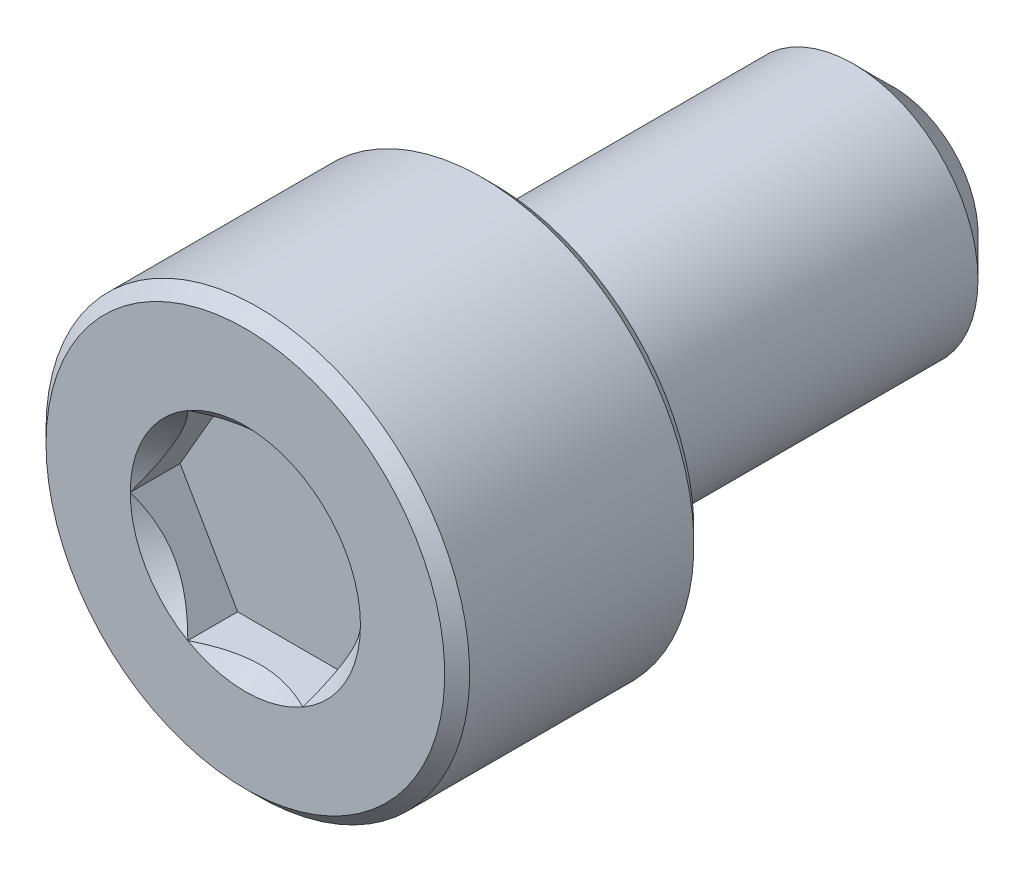
ISO-10303-21;
HEADER;
FILE_DESCRIPTION(('STEP AP214'),'2;1');
FILE_NAME('part.step','',(''),(''),'','','');
FILE_SCHEMA(('AUTOMOTIVE_DESIGN { 1 0 10303 214 1 1 1 1 }'));
ENDSEC;
DATA;
#1=APPLICATION_CONTEXT('core data for automotive mechanical design processes');
#2=APPLICATION_PROTOCOL_DEFINITION('international standard','automotive_design',2000,#1);
#3=PRODUCT_CONTEXT('',#1,'mechanical');
#4=PRODUCT('Part','Part','',(#3));
#5=PRODUCT_RELATED_PRODUCT_CATEGORY('part','',(#4));
#6=PRODUCT_DEFINITION_FORMATION('','',#4);
#7=PRODUCT_DEFINITION_CONTEXT('part definition',#1,'design');
#8=PRODUCT_DEFINITION('design','',#6,#7);
#9=PRODUCT_DEFINITION_SHAPE('','',#8);
#10=(LENGTH_UNIT() NAMED_UNIT(*) SI_UNIT(.MILLI.,.METRE.));
#11=(NAMED_UNIT(*) PLANE_ANGLE_UNIT() SI_UNIT($,.RADIAN.));
#12=(NAMED_UNIT(*) SI_UNIT($,.STERADIAN.) SOLID_ANGLE_UNIT());
#13=UNCERTAINTY_MEASURE_WITH_UNIT(LENGTH_MEASURE(1.E-05),#10,'distance_accuracy_value','');
#14=(GEOMETRIC_REPRESENTATION_CONTEXT(3) GLOBAL_UNCERTAINTY_ASSIGNED_CONTEXT((#13)) GLOBAL_UNIT_ASSIGNED_CONTEXT((#10,
#11,#12)) REPRESENTATION_CONTEXT('',''));
#15=CARTESIAN_POINT('',(0.,0.,0.));
#16=DIRECTION('',(0.,0.,1.));
#17=DIRECTION('',(1.,0.,0.));
#18=AXIS2_PLACEMENT_3D('',#15,#16,#17);
#19=CARTESIAN_POINT('',(0.,4.,6.5));
#20=DIRECTION('',(0.,0.,1.));
#21=DIRECTION('',(1.,0.,0.));
#22=AXIS2_PLACEMENT_3D('',#19,#20,#21);
#23=PLANE('',#22);
#24=CARTESIAN_POINT('',(0.,0.,6.5));
#25=DIRECTION('',(0.,0.,1.));
#26=DIRECTION('',(1.,0.,0.));
#27=AXIS2_PLACEMENT_3D('',#24,#25,#26);
#28=CIRCLE('',#27,2.3094010767585);
#29=CARTESIAN_POINT('',(2.3094010767585,0.,6.5));
#30=VERTEX_POINT('',#29);
#31=CARTESIAN_POINT('',(1.15470053837925,2.,6.5));
#32=VERTEX_POINT('',#31);
#33=EDGE_CURVE('E95',#30,#32,#28,.T.);
#34=ORIENTED_EDGE('',*,*,#33,.F.);
#35=CARTESIAN_POINT('',(1.15470053837925,-2.,6.5));
#36=VERTEX_POINT('',#35);
#37=EDGE_CURVE('E55',#36,#30,#28,.T.);
#38=ORIENTED_EDGE('',*,*,#37,.F.);
#39=CARTESIAN_POINT('',(-1.15470053837925,-2.,6.5));
#40=VERTEX_POINT('',#39);
#41=EDGE_CURVE('E298',#40,#36,#28,.T.);
#42=ORIENTED_EDGE('',*,*,#41,.F.);
#43=CARTESIAN_POINT('',(-2.3094010767585,0.,6.5));
#44=VERTEX_POINT('',#43);
#45=EDGE_CURVE('E62',#44,#40,#28,.T.);
#46=ORIENTED_EDGE('',*,*,#45,.F.);
#47=CARTESIAN_POINT('',(-1.15470053837925,2.,6.5));
#48=VERTEX_POINT('',#47);
#49=EDGE_CURVE('E130',#48,#44,#28,.T.);
#50=ORIENTED_EDGE('',*,*,#49,.F.);
#51=EDGE_CURVE('E104',#32,#48,#28,.T.);
#52=ORIENTED_EDGE('',*,*,#51,.F.);
#53=EDGE_LOOP('',(#34,#38,#42,#46,#50,#52));
#54=FACE_BOUND('',#53,.T.);
#55=CARTESIAN_POINT('',(0.,0.,6.5));
#56=DIRECTION('',(0.,0.,-1.));
#57=DIRECTION('',(-1.,0.,0.));
#58=AXIS2_PLACEMENT_3D('',#55,#56,#57);
#59=CIRCLE('',#58,4.);
#60=CARTESIAN_POINT('',(-4.,0.,6.5));
#61=VERTEX_POINT('',#60);
#62=EDGE_CURVE('E49',#61,#61,#59,.T.);
#63=ORIENTED_EDGE('',*,*,#62,.F.);
#64=EDGE_LOOP('',(#63));
#65=FACE_BOUND('',#64,.T.);
#66=ADVANCED_FACE('F36',(#54,#65),#23,.T.);
#67=CARTESIAN_POINT('',(0.,0.,6.25));
#68=DIRECTION('',(0.,0.,-1.));
#69=DIRECTION('',(-1.,0.,0.));
#70=AXIS2_PLACEMENT_3D('',#67,#68,#69);
#71=CONICAL_SURFACE('',#70,4.25,0.785398163397447);
#72=ORIENTED_EDGE('',*,*,#62,.T.);
#73=EDGE_LOOP('',(#72));
#74=FACE_BOUND('',#73,.T.);
#75=CARTESIAN_POINT('',(0.,0.,6.25));
#76=DIRECTION('',(0.,0.,-1.));
#77=DIRECTION('',(-1.,0.,0.));
#78=AXIS2_PLACEMENT_3D('',#75,#76,#77);
#79=CIRCLE('',#78,4.25);
#80=CARTESIAN_POINT('',(-4.25,0.,6.25));
#81=VERTEX_POINT('',#80);
#82=EDGE_CURVE('E273',#81,#81,#79,.T.);
#83=ORIENTED_EDGE('',*,*,#82,.F.);
#84=EDGE_LOOP('',(#83));
#85=FACE_BOUND('',#84,.T.);
#86=ADVANCED_FACE('F194',(#74,#85),#71,.T.);
#87=CARTESIAN_POINT('',(0.,0.,-6.5));
#88=DIRECTION('',(0.,0.,-1.));
#89=DIRECTION('',(-1.,0.,0.));
#90=AXIS2_PLACEMENT_3D('',#87,#88,#89);
#91=CYLINDRICAL_SURFACE('',#90,4.25);
#92=ORIENTED_EDGE('',*,*,#82,.T.);
#93=EDGE_LOOP('',(#92));
#94=FACE_BOUND('',#93,.T.);
#95=CARTESIAN_POINT('',(0.,0.,1.75));
#96=DIRECTION('',(0.,0.,-1.));
#97=DIRECTION('',(-1.,0.,0.));
#98=AXIS2_PLACEMENT_3D('',#95,#96,#97);
#99=CIRCLE('',#98,4.25);
#100=CARTESIAN_POINT('',(-4.25,0.,1.75));
#101=VERTEX_POINT('',#100);
#102=EDGE_CURVE('E270',#101,#101,#99,.T.);
#103=ORIENTED_EDGE('',*,*,#102,.F.);
#104=EDGE_LOOP('',(#103));
#105=FACE_BOUND('',#104,.T.);
#106=ADVANCED_FACE('F198',(#94,#105),#91,.T.);
#107=CARTESIAN_POINT('',(0.,0.,1.5));
#108=DIRECTION('',(0.,0.,1.));
#109=DIRECTION('',(1.,0.,0.));
#110=AXIS2_PLACEMENT_3D('',#107,#108,#109);
#111=CONICAL_SURFACE('',#110,4.,0.785398163397448);
#112=ORIENTED_EDGE('',*,*,#102,.T.);
#113=EDGE_LOOP('',(#112));
#114=FACE_BOUND('',#113,.T.);
#115=CARTESIAN_POINT('',(0.,0.,1.5));
#116=DIRECTION('',(0.,0.,-1.));
#117=DIRECTION('',(-1.,0.,0.));
#118=AXIS2_PLACEMENT_3D('',#115,#116,#117);
#119=CIRCLE('',#118,4.);
#120=CARTESIAN_POINT('',(-4.,0.,1.5));
#121=VERTEX_POINT('',#120);
#122=EDGE_CURVE('E267',#121,#121,#119,.T.);
#123=ORIENTED_EDGE('',*,*,#122,.F.);
#124=EDGE_LOOP('',(#123));
#125=FACE_BOUND('',#124,.T.);
#126=ADVANCED_FACE('F203',(#114,#125),#111,.T.);
#127=CARTESIAN_POINT('',(0.,4.,1.5));
#128=DIRECTION('',(0.,0.,-1.));
#129=DIRECTION('',(-1.,0.,0.));
#130=AXIS2_PLACEMENT_3D('',#127,#128,#129);
#131=PLANE('',#130);
#132=ORIENTED_EDGE('',*,*,#122,.T.);
#133=EDGE_LOOP('',(#132));
#134=FACE_BOUND('',#133,.T.);
#135=CARTESIAN_POINT('',(0.,0.,1.5));
#136=DIRECTION('',(0.,0.,-1.));
#137=DIRECTION('',(-1.,0.,0.));
#138=AXIS2_PLACEMENT_3D('',#135,#136,#137);
#139=CIRCLE('',#138,2.5);
#140=CARTESIAN_POINT('',(-2.5,0.,1.5));
#141=VERTEX_POINT('',#140);
#142=EDGE_CURVE('E264',#141,#141,#139,.T.);
#143=ORIENTED_EDGE('',*,*,#142,.F.);
#144=EDGE_LOOP('',(#143));
#145=FACE_BOUND('',#144,.T.);
#146=ADVANCED_FACE('F211',(#134,#145),#131,.T.);
#147=CARTESIAN_POINT('',(0.,0.,-6.5));
#148=DIRECTION('',(0.,0.,-1.));
#149=DIRECTION('',(-1.,0.,0.));
#150=AXIS2_PLACEMENT_3D('',#147,#148,#149);
#151=CYLINDRICAL_SURFACE('',#150,2.5);
#152=ORIENTED_EDGE('',*,*,#142,.T.);
#153=EDGE_LOOP('',(#152));
#154=FACE_BOUND('',#153,.T.);
#155=CARTESIAN_POINT('',(0.,0.,-5.69999999999999));
#156=DIRECTION('',(0.,0.,-1.));
#157=DIRECTION('',(-1.,0.,0.));
#158=AXIS2_PLACEMENT_3D('',#155,#156,#157);
#159=CIRCLE('',#158,2.5);
#160=CARTESIAN_POINT('',(-2.5,0.,-5.69999999999999));
#161=VERTEX_POINT('',#160);
#162=EDGE_CURVE('E261',#161,#161,#159,.T.);
#163=ORIENTED_EDGE('',*,*,#162,.F.);
#164=EDGE_LOOP('',(#163));
#165=FACE_BOUND('',#164,.T.);
#166=ADVANCED_FACE('F215',(#154,#165),#151,.T.);
#167=CARTESIAN_POINT('',(0.,0.,-6.5));
#168=DIRECTION('',(0.,0.,1.));
#169=DIRECTION('',(1.,0.,0.));
#170=AXIS2_PLACEMENT_3D('',#167,#168,#169);
#171=CONICAL_SURFACE('',#170,1.7,0.785398163397443);
#172=ORIENTED_EDGE('',*,*,#162,.T.);
#173=EDGE_LOOP('',(#172));
#174=FACE_BOUND('',#173,.T.);
#175=CARTESIAN_POINT('',(0.,0.,-6.5));
#176=DIRECTION('',(0.,0.,-1.));
#177=DIRECTION('',(-1.,0.,0.));
#178=AXIS2_PLACEMENT_3D('',#175,#176,#177);
#179=CIRCLE('',#178,1.7);
#180=CARTESIAN_POINT('',(-1.7,0.,-6.5));
#181=VERTEX_POINT('',#180);
#182=EDGE_CURVE('E243',#181,#181,#179,.T.);
#183=ORIENTED_EDGE('',*,*,#182,.F.);
#184=EDGE_LOOP('',(#183));
#185=FACE_BOUND('',#184,.T.);
#186=ADVANCED_FACE('F219',(#174,#185),#171,.T.);
#187=CARTESIAN_POINT('',(0.,1.7,-6.5));
#188=DIRECTION('',(0.,0.,-1.));
#189=DIRECTION('',(-1.,0.,0.));
#190=AXIS2_PLACEMENT_3D('',#187,#188,#189);
#191=PLANE('',#190);
#192=ORIENTED_EDGE('',*,*,#182,.T.);
#193=EDGE_LOOP('',(#192));
#194=FACE_BOUND('',#193,.T.);
#195=ADVANCED_FACE('F223',(#194),#191,.T.);
#196=CARTESIAN_POINT('',(0.,0.,6.5));
#197=DIRECTION('',(0.,0.,1.));
#198=DIRECTION('',(1.,0.,0.));
#199=AXIS2_PLACEMENT_3D('',#196,#197,#198);
#200=CONICAL_SURFACE('',#199,2.3094010767585,0.78539816339745);
#201=ORIENTED_EDGE('',*,*,#51,.T.);
#202=CARTESIAN_POINT('',(-2.33350792809314,2.,7.26391297333034));
#203=CARTESIAN_POINT('',(-2.27682524005105,2.,7.22088465819452));
#204=CARTESIAN_POINT('',(-2.21982863127677,2.,7.17826321968666));
#205=CARTESIAN_POINT('',(-2.10508243227164,2.,7.09401735382318));
#206=CARTESIAN_POINT('',(-2.04733265969732,2.,7.05239317509694));
#207=CARTESIAN_POINT('',(-1.9305325076875,2.,6.97002893909808));
#208=CARTESIAN_POINT('',(-1.87147552066419,2.,6.929298220564));
#209=CARTESIAN_POINT('',(-1.75236453496771,2.,6.84932648957119));
#210=CARTESIAN_POINT('',(-1.69231060660119,2.,6.81008537269831));
#211=CARTESIAN_POINT('',(-1.567471533448,2.,6.73116787888498));
#212=CARTESIAN_POINT('',(-1.50261611656329,2.,6.69160210237478));
#213=CARTESIAN_POINT('',(-1.37138716901082,2.,6.61502921587276));
#214=CARTESIAN_POINT('',(-1.30501336962871,2.,6.57802256351504));
#215=CARTESIAN_POINT('',(-1.17075263037878,2.,6.50736673923406));
#216=CARTESIAN_POINT('',(-1.10287104348427,2.,6.47370747514608));
#217=CARTESIAN_POINT('',(-0.96522809254686,2.,6.41049315112672));
#218=CARTESIAN_POINT('',(-0.895467367515904,2.,6.38093671652697));
#219=CARTESIAN_POINT('',(-0.760038155655725,2.,6.32931025785436));
#220=CARTESIAN_POINT('',(-0.694533426178473,2.,6.30681508107925));
#221=CARTESIAN_POINT('',(-0.561920164972266,2.,6.26707588844303));
#222=CARTESIAN_POINT('',(-0.494811525645963,2.,6.24983222594905));
#223=CARTESIAN_POINT('',(-0.360522211095494,2.,6.22179275650282));
#224=CARTESIAN_POINT('',(-0.293365389163157,2.,6.21088458822734));
#225=CARTESIAN_POINT('',(-0.158300090029279,2.,6.19573270261191));
#226=CARTESIAN_POINT('',(-0.0903917516002768,2.,6.19148777487641));
#227=CARTESIAN_POINT('',(0.0429020652606314,2.,6.18999114215311));
#228=CARTESIAN_POINT('',(0.108284684169079,2.,6.1924781450741));
#229=CARTESIAN_POINT('',(0.23850440969295,2.,6.20372439320255));
#230=CARTESIAN_POINT('',(0.303341463641696,2.,6.21248423709365));
#231=CARTESIAN_POINT('',(0.433098840648744,2.,6.23594152298035));
#232=CARTESIAN_POINT('',(0.498000415627631,2.,6.25074108464347));
#233=CARTESIAN_POINT('',(0.626381661351717,2.,6.2854820388306));
#234=CARTESIAN_POINT('',(0.689861439952175,2.,6.3054230398874));
#235=CARTESIAN_POINT('',(0.888345745687482,2.,6.37531214536041));
#236=CARTESIAN_POINT('',(1.02055912670982,2.,6.43316247106279));
#237=CARTESIAN_POINT('',(1.27879697777602,2.,6.56182319594991));
#238=CARTESIAN_POINT('',(1.40479723810912,2.,6.63267988107336));
#239=CARTESIAN_POINT('',(1.58692013279987,2.,6.74327963632549));
#240=CARTESIAN_POINT('',(1.64501521895223,2.,6.77983824352554));
#241=CARTESIAN_POINT('',(1.76020814703228,2.,6.85450591449783));
#242=CARTESIAN_POINT('',(1.81730591318335,2.,6.8926150953569));
#243=CARTESIAN_POINT('',(1.93017247334116,2.,6.96978646473081));
#244=CARTESIAN_POINT('',(1.9859482832833,2.,7.00883844345984));
#245=CARTESIAN_POINT('',(2.09673667795809,2.,7.08797979648984));
#246=CARTESIAN_POINT('',(2.15174946854703,2.,7.1280688822828));
#247=CARTESIAN_POINT('',(2.20644261038877,2.,7.16858297171107));
#248=B_SPLINE_CURVE_WITH_KNOTS('',3,(#202,#203,#204,#205,#206,#207,#208,#209,#210,#211,#212,
#213,#214,#215,#216,#217,#218,#219,#220,#221,#222,#223,#224,#225,#226,#227,#228,#229,#230,#231,
#232,#233,#234,#235,#236,#237,#238,#239,#240,#241,#242,#243,#244,#245,#246,#247),.UNSPECIFIED.,
.F.,.F.,(4,2,2,2,2,2,2,2,2,2,2,2,2,2,2,2,2,2,2,2,2,2,4),(0.,0.213497148294752,0.427046981593394,
0.642249974749848,0.857437855216921,1.08530552050929,1.31321382930987,1.54041273599371,
1.76753533413947,1.97513287362836,2.18274437898411,2.38655158594355,2.59032176649044,
2.78629737352115,2.98229168707252,3.18174703964799,3.38118721025193,3.81287365989454,
4.24612724012855,4.45203046308782,4.65794926316182,4.86220142187745,5.06639735899164),.UNSPECIFIED.);
#249=EDGE_CURVE('E12',#32,#48,#248,.F.);
#250=ORIENTED_EDGE('',*,*,#249,.F.);
#251=EDGE_LOOP('',(#201,#250));
#252=FACE_BOUND('',#251,.T.);
#253=ADVANCED_FACE('F108',(#252),#200,.F.);
#254=ORIENTED_EDGE('',*,*,#49,.T.);
#255=CARTESIAN_POINT('',(-1.15458506832541,2.0002,6.50011547871366));
#256=CARTESIAN_POINT('',(-1.19427965103064,1.93144696596929,6.46045309022559));
#257=CARTESIAN_POINT('',(-1.23463799837204,1.86154425786449,6.42311998228416));
#258=CARTESIAN_POINT('',(-1.31693321846145,1.71900475544956,6.35476368513614));
#259=CARTESIAN_POINT('',(-1.35887791933134,1.64635440243464,6.32377853373722));
#260=CARTESIAN_POINT('',(-1.44345742638069,1.49985839894603,6.27070021654414));
#261=CARTESIAN_POINT('',(-1.48607068799507,1.42605006475371,6.24847362717661));
#262=CARTESIAN_POINT('',(-1.57223542169503,1.27680836816474,6.21422881667508));
#263=CARTESIAN_POINT('',(-1.61578426088223,1.20137956608185,6.20218502914414));
#264=CARTESIAN_POINT('',(-1.69083694766536,1.07138449932892,6.19131851190557));
#265=CARTESIAN_POINT('',(-1.72224381117151,1.01698621602989,6.18970975360997));
#266=CARTESIAN_POINT('',(-1.78500621460364,0.908278544480308,6.19241887759871));
#267=CARTESIAN_POINT('',(-1.81636173267754,0.853969194078662,6.19673883775797));
#268=CARTESIAN_POINT('',(-1.87877671565355,0.745863272410663,6.21105956740991));
#269=CARTESIAN_POINT('',(-1.90983580972306,0.692067343445209,6.22106669276201));
#270=CARTESIAN_POINT('',(-1.97141691651547,0.585405737694428,6.24621243024966));
#271=CARTESIAN_POINT('',(-2.00193897021859,0.532539989929289,6.26135064904224));
#272=CARTESIAN_POINT('',(-2.08012358375727,0.397120266910157,6.30629450342919));
#273=CARTESIAN_POINT('',(-2.12730124240478,0.315406165150523,6.33948883942582));
#274=CARTESIAN_POINT('',(-2.19667172615922,0.195252962742199,6.39552582317137));
#275=CARTESIAN_POINT('',(-2.21953238052245,0.155657147890825,6.41521470294694));
#276=CARTESIAN_POINT('',(-2.26483018959123,0.0771990411121292,6.45638731836487));
#277=CARTESIAN_POINT('',(-2.28726759416161,0.0383363164062607,6.47786995165125));
#278=CARTESIAN_POINT('',(-2.30951654681234,-0.000199999999999359,6.50011547871366));
#279=B_SPLINE_CURVE_WITH_KNOTS('',3,(#255,#256,#257,#258,#259,#260,#261,#262,#263,#264,#265,
#266,#267,#268,#269,#270,#271,#272,#273,#274,#275,#276,#277,#278),.UNSPECIFIED.,.F.,.F.,(4,2,2,
2,2,2,2,2,2,2,2,4),(0.,0.266420613771063,0.534393751523388,0.798110374376913,1.06116288956936,
1.24939906803721,1.43770123566247,1.62621426093931,1.81471283831913,2.11415604834144,
2.2634717071779,2.41269626969771),.UNSPECIFIED.);
#280=EDGE_CURVE('E103',#48,#44,#279,.T.);
#281=ORIENTED_EDGE('',*,*,#280,.F.);
#282=EDGE_LOOP('',(#254,#281));
#283=FACE_BOUND('',#282,.T.);
#284=ADVANCED_FACE('F306',(#283),#200,.F.);
#285=ORIENTED_EDGE('',*,*,#45,.T.);
#286=CARTESIAN_POINT('',(-2.30951654681234,0.000200000000000642,6.50011547871366));
#287=CARTESIAN_POINT('',(-2.26982196410711,-0.0685530340307052,6.46045309022559));
#288=CARTESIAN_POINT('',(-2.22946361676572,-0.138455742135511,6.42311998228416));
#289=CARTESIAN_POINT('',(-2.1471683966763,-0.280995244550436,6.35476368513614));
#290=CARTESIAN_POINT('',(-2.10522369580642,-0.353645597565358,6.32377853373722));
#291=CARTESIAN_POINT('',(-2.02064418875706,-0.500141601053971,6.27070021654414));
#292=CARTESIAN_POINT('',(-1.97803092714269,-0.573949935246295,6.24847362717661));
#293=CARTESIAN_POINT('',(-1.89186619344273,-0.723191631835264,6.21422881667508));
#294=CARTESIAN_POINT('',(-1.84831735425552,-0.798620433918152,6.20218502914413));
#295=CARTESIAN_POINT('',(-1.7732646674724,-0.92861550067108,6.19131851190557));
#296=CARTESIAN_POINT('',(-1.74185780396625,-0.983013783970109,6.18970975360997));
#297=CARTESIAN_POINT('',(-1.67909540053412,-1.09172145551969,6.19241887759871));
#298=CARTESIAN_POINT('',(-1.64773988246021,-1.14603080592134,6.19673883775797));
#299=CARTESIAN_POINT('',(-1.5853248994842,-1.25413672758934,6.21105956740991));
#300=CARTESIAN_POINT('',(-1.55426580541469,-1.30793265655479,6.22106669276201));
#301=CARTESIAN_POINT('',(-1.49268469862228,-1.41459426230557,6.24621243024966));
#302=CARTESIAN_POINT('',(-1.46216264491916,-1.46746001007071,6.26135064904224));
#303=CARTESIAN_POINT('',(-1.38397803138048,-1.60287973308984,6.30629450342919));
#304=CARTESIAN_POINT('',(-1.33680037273297,-1.68459383484948,6.33948883942582));
#305=CARTESIAN_POINT('',(-1.26742988897853,-1.8047470372578,6.39552582317137));
#306=CARTESIAN_POINT('',(-1.24456923461531,-1.84434285210918,6.41521470294694));
#307=CARTESIAN_POINT('',(-1.19927142554652,-1.92280095888787,6.45638731836487));
#308=CARTESIAN_POINT('',(-1.17683402097614,-1.96166368359374,6.47786995165125));
#309=CARTESIAN_POINT('',(-1.15458506832541,-2.0002,6.50011547871366));
#310=B_SPLINE_CURVE_WITH_KNOTS('',3,(#286,#287,#288,#289,#290,#291,#292,#293,#294,#295,#296,
#297,#298,#299,#300,#301,#302,#303,#304,#305,#306,#307,#308,#309),.UNSPECIFIED.,.F.,.F.,(4,2,2,
2,2,2,2,2,2,2,2,4),(0.,0.266420613771064,0.53439375152339,0.798110374376916,1.06116288956937,
1.24939906803722,1.43770123566248,1.62621426093932,1.81471283831913,2.11415604834145,
2.26347170717791,2.41269626969771),.UNSPECIFIED.);
#311=EDGE_CURVE('E139',#44,#40,#310,.T.);
#312=ORIENTED_EDGE('',*,*,#311,.F.);
#313=EDGE_LOOP('',(#285,#312));
#314=FACE_BOUND('',#313,.T.);
#315=ADVANCED_FACE('F301',(#314),#200,.F.);
#316=ORIENTED_EDGE('',*,*,#41,.T.);
#317=CARTESIAN_POINT('',(-2.33350792809314,-2.,7.26391297333034));
#318=CARTESIAN_POINT('',(-2.27682524005105,-2.,7.22088465819452));
#319=CARTESIAN_POINT('',(-2.21982863127678,-2.,7.17826321968666));
#320=CARTESIAN_POINT('',(-2.10508243227164,-2.,7.09401735382318));
#321=CARTESIAN_POINT('',(-2.04733265969732,-2.,7.05239317509694));
#322=CARTESIAN_POINT('',(-1.9305325076875,-2.,6.97002893909808));
#323=CARTESIAN_POINT('',(-1.87147552066419,-2.,6.929298220564));
#324=CARTESIAN_POINT('',(-1.75236453496771,-2.,6.84932648957119));
#325=CARTESIAN_POINT('',(-1.69231060660119,-2.,6.81008537269831));
#326=CARTESIAN_POINT('',(-1.567471533448,-2.,6.73116787888498));
#327=CARTESIAN_POINT('',(-1.50261611656329,-2.,6.69160210237478));
#328=CARTESIAN_POINT('',(-1.37138716901082,-2.,6.61502921587276));
#329=CARTESIAN_POINT('',(-1.30501336962871,-2.,6.57802256351504));
#330=CARTESIAN_POINT('',(-1.17075263037878,-2.,6.50736673923406));
#331=CARTESIAN_POINT('',(-1.10287104348428,-2.,6.47370747514608));
#332=CARTESIAN_POINT('',(-0.965228092546861,-2.,6.41049315112672));
#333=CARTESIAN_POINT('',(-0.895467367515904,-2.,6.38093671652697));
#334=CARTESIAN_POINT('',(-0.760038155655725,-2.,6.32931025785436));
#335=CARTESIAN_POINT('',(-0.694533426178474,-2.,6.30681508107925));
#336=CARTESIAN_POINT('',(-0.561920164972266,-2.,6.26707588844303));
#337=CARTESIAN_POINT('',(-0.494811525645963,-2.,6.24983222594905));
#338=CARTESIAN_POINT('',(-0.360522211095494,-2.,6.22179275650282));
#339=CARTESIAN_POINT('',(-0.293365389163157,-2.,6.21088458822734));
#340=CARTESIAN_POINT('',(-0.158300090029279,-2.,6.19573270261191));
#341=CARTESIAN_POINT('',(-0.0903917516002766,-2.,6.19148777487641));
#342=CARTESIAN_POINT('',(0.0429020652606316,-2.,6.1899911421531));
#343=CARTESIAN_POINT('',(0.108284684169079,-2.,6.1924781450741));
#344=CARTESIAN_POINT('',(0.23850440969295,-2.,6.20372439320255));
#345=CARTESIAN_POINT('',(0.303341463641696,-2.,6.21248423709364));
#346=CARTESIAN_POINT('',(0.433098840648744,-2.,6.23594152298035));
#347=CARTESIAN_POINT('',(0.498000415627631,-2.,6.25074108464347));
#348=CARTESIAN_POINT('',(0.626381661351717,-2.,6.2854820388306));
#349=CARTESIAN_POINT('',(0.689861439952175,-2.,6.3054230398874));
#350=CARTESIAN_POINT('',(0.888345745687483,-2.,6.37531214536041));
#351=CARTESIAN_POINT('',(1.02055912670982,-2.,6.43316247106279));
#352=CARTESIAN_POINT('',(1.27879697777602,-2.,6.56182319594991));
#353=CARTESIAN_POINT('',(1.40479723810912,-2.,6.63267988107336));
#354=CARTESIAN_POINT('',(1.58692013279986,-2.,6.74327963632549));
#355=CARTESIAN_POINT('',(1.64501521895223,-2.,6.77983824352554));
#356=CARTESIAN_POINT('',(1.76020814703228,-2.,6.85450591449782));
#357=CARTESIAN_POINT('',(1.81730591318335,-2.,6.8926150953569));
#358=CARTESIAN_POINT('',(1.93017247334116,-2.,6.96978646473081));
#359=CARTESIAN_POINT('',(1.9859482832833,-2.,7.00883844345984));
#360=CARTESIAN_POINT('',(2.09673667795809,-2.,7.08797979648983));
#361=CARTESIAN_POINT('',(2.15174946854703,-2.,7.1280688822828));
#362=CARTESIAN_POINT('',(2.20644261038877,-2.,7.16858297171107));
#363=B_SPLINE_CURVE_WITH_KNOTS('',3,(#317,#318,#319,#320,#321,#322,#323,#324,#325,#326,#327,
#328,#329,#330,#331,#332,#333,#334,#335,#336,#337,#338,#339,#340,#341,#342,#343,#344,#345,#346,
#347,#348,#349,#350,#351,#352,#353,#354,#355,#356,#357,#358,#359,#360,#361,#362),.UNSPECIFIED.,
.F.,.F.,(4,2,2,2,2,2,2,2,2,2,2,2,2,2,2,2,2,2,2,2,2,2,4),(0.,0.213497148294752,0.427046981593395,
0.642249974749849,0.857437855216922,1.08530552050929,1.31321382930987,1.54041273599371,
1.76753533413947,1.97513287362836,2.18274437898411,2.38655158594355,2.59032176649044,
2.78629737352115,2.98229168707253,3.18174703964799,3.38118721025194,3.81287365989454,
4.24612724012855,4.45203046308782,4.65794926316182,4.86220142187746,5.06639735899165),.UNSPECIFIED.);
#364=EDGE_CURVE('E159',#40,#36,#363,.T.);
#365=ORIENTED_EDGE('',*,*,#364,.F.);
#366=EDGE_LOOP('',(#316,#365));
#367=FACE_BOUND('',#366,.T.);
#368=ADVANCED_FACE('F299',(#367),#200,.F.);
#369=ORIENTED_EDGE('',*,*,#37,.T.);
#370=CARTESIAN_POINT('',(1.15458506832541,-2.0002,6.50011547871366));
#371=CARTESIAN_POINT('',(1.19427965103064,-1.93144696596929,6.46045309022559));
#372=CARTESIAN_POINT('',(1.23463799837204,-1.86154425786449,6.42311998228416));
#373=CARTESIAN_POINT('',(1.31693321846145,-1.71900475544956,6.35476368513614));
#374=CARTESIAN_POINT('',(1.35887791933134,-1.64635440243464,6.32377853373722));
#375=CARTESIAN_POINT('',(1.44345742638069,-1.49985839894603,6.27070021654414));
#376=CARTESIAN_POINT('',(1.48607068799507,-1.42605006475371,6.24847362717661));
#377=CARTESIAN_POINT('',(1.57223542169502,-1.27680836816474,6.21422881667508));
#378=CARTESIAN_POINT('',(1.61578426088223,-1.20137956608185,6.20218502914413));
#379=CARTESIAN_POINT('',(1.69083694766536,-1.07138449932892,6.19131851190557));
#380=CARTESIAN_POINT('',(1.72224381117151,-1.01698621602989,6.18970975360997));
#381=CARTESIAN_POINT('',(1.78500621460364,-0.908278544480307,6.19241887759871));
#382=CARTESIAN_POINT('',(1.81636173267754,-0.853969194078662,6.19673883775797));
#383=CARTESIAN_POINT('',(1.87877671565355,-0.745863272410662,6.21105956740991));
#384=CARTESIAN_POINT('',(1.90983580972306,-0.692067343445208,6.22106669276201));
#385=CARTESIAN_POINT('',(1.97141691651547,-0.585405737694427,6.24621243024966));
#386=CARTESIAN_POINT('',(2.00193897021859,-0.532539989929288,6.26135064904224));
#387=CARTESIAN_POINT('',(2.08012358375727,-0.397120266910156,6.30629450342919));
#388=CARTESIAN_POINT('',(2.12730124240478,-0.315406165150522,6.33948883942582));
#389=CARTESIAN_POINT('',(2.19667172615922,-0.195252962742198,6.39552582317137));
#390=CARTESIAN_POINT('',(2.21953238052245,-0.155657147890823,6.41521470294694));
#391=CARTESIAN_POINT('',(2.26483018959123,-0.0771990411121277,6.45638731836487));
#392=CARTESIAN_POINT('',(2.28726759416161,-0.0383363164062597,6.47786995165125));
#393=CARTESIAN_POINT('',(2.30951654681234,0.000200000000000026,6.50011547871366));
#394=B_SPLINE_CURVE_WITH_KNOTS('',3,(#370,#371,#372,#373,#374,#375,#376,#377,#378,#379,#380,
#381,#382,#383,#384,#385,#386,#387,#388,#389,#390,#391,#392,#393),.UNSPECIFIED.,.F.,.F.,(4,2,2,
2,2,2,2,2,2,2,2,4),(0.,0.266420613771063,0.534393751523388,0.798110374376913,1.06116288956936,
1.24939906803721,1.43770123566247,1.62621426093931,1.81471283831913,2.11415604834145,
2.2634717071779,2.41269626969771),.UNSPECIFIED.);
#395=EDGE_CURVE('E120',#36,#30,#394,.T.);
#396=ORIENTED_EDGE('',*,*,#395,.F.);
#397=EDGE_LOOP('',(#369,#396));
#398=FACE_BOUND('',#397,.T.);
#399=ADVANCED_FACE('F152',(#398),#200,.F.);
#400=ORIENTED_EDGE('',*,*,#33,.T.);
#401=CARTESIAN_POINT('',(2.30951654681234,-0.000199999999999628,6.50011547871366));
#402=CARTESIAN_POINT('',(2.26982196410711,0.0685530340307057,6.46045309022559));
#403=CARTESIAN_POINT('',(2.22946361676572,0.138455742135512,6.42311998228416));
#404=CARTESIAN_POINT('',(2.1471683966763,0.280995244550436,6.35476368513614));
#405=CARTESIAN_POINT('',(2.10522369580642,0.353645597565358,6.32377853373722));
#406=CARTESIAN_POINT('',(2.02064418875706,0.500141601053971,6.27070021654414));
#407=CARTESIAN_POINT('',(1.97803092714269,0.573949935246294,6.24847362717661));
#408=CARTESIAN_POINT('',(1.89186619344273,0.723191631835264,6.21422881667508));
#409=CARTESIAN_POINT('',(1.84831735425552,0.798620433918151,6.20218502914414));
#410=CARTESIAN_POINT('',(1.7732646674724,0.928615500671079,6.19131851190557));
#411=CARTESIAN_POINT('',(1.74185780396625,0.983013783970109,6.18970975360997));
#412=CARTESIAN_POINT('',(1.67909540053412,1.09172145551969,6.19241887759871));
#413=CARTESIAN_POINT('',(1.64773988246021,1.14603080592134,6.19673883775797));
#414=CARTESIAN_POINT('',(1.5853248994842,1.25413672758934,6.21105956740991));
#415=CARTESIAN_POINT('',(1.55426580541469,1.30793265655479,6.22106669276201));
#416=CARTESIAN_POINT('',(1.49268469862228,1.41459426230557,6.24621243024966));
#417=CARTESIAN_POINT('',(1.46216264491917,1.46746001007071,6.26135064904224));
#418=CARTESIAN_POINT('',(1.38397803138049,1.60287973308984,6.30629450342919));
#419=CARTESIAN_POINT('',(1.33680037273297,1.68459383484948,6.33948883942582));
#420=CARTESIAN_POINT('',(1.26742988897853,1.8047470372578,6.39552582317137));
#421=CARTESIAN_POINT('',(1.24456923461531,1.84434285210918,6.41521470294694));
#422=CARTESIAN_POINT('',(1.19927142554652,1.92280095888787,6.45638731836487));
#423=CARTESIAN_POINT('',(1.17683402097614,1.96166368359374,6.47786995165125));
#424=CARTESIAN_POINT('',(1.15458506832541,2.0002,6.50011547871366));
#425=B_SPLINE_CURVE_WITH_KNOTS('',3,(#401,#402,#403,#404,#405,#406,#407,#408,#409,#410,#411,
#412,#413,#414,#415,#416,#417,#418,#419,#420,#421,#422,#423,#424),.UNSPECIFIED.,.F.,.F.,(4,2,2,
2,2,2,2,2,2,2,2,4),(0.,0.266420613771063,0.534393751523387,0.798110374376913,1.06116288956936,
1.24939906803722,1.43770123566247,1.62621426093931,1.81471283831913,2.11415604834145,
2.2634717071779,2.41269626969771),.UNSPECIFIED.);
#426=EDGE_CURVE('E99',#30,#32,#425,.T.);
#427=ORIENTED_EDGE('',*,*,#426,.F.);
#428=EDGE_LOOP('',(#400,#427));
#429=FACE_BOUND('',#428,.T.);
#430=ADVANCED_FACE('F97',(#429),#200,.F.);
#431=CARTESIAN_POINT('',(0.,4.,5.5));
#432=DIRECTION('',(0.,0.,1.));
#433=DIRECTION('',(1.,0.,0.));
#434=AXIS2_PLACEMENT_3D('',#431,#432,#433);
#435=PLANE('',#434);
#436=DIRECTION('',(0.5,-0.866025403784439,0.));
#437=VECTOR('',#436,1.);
#438=CARTESIAN_POINT('',(2.3094010767585,0.,5.5));
#439=LINE('',#438,#437);
#440=CARTESIAN_POINT('',(1.15470053837925,2.,5.5));
#441=VERTEX_POINT('',#440);
#442=CARTESIAN_POINT('',(2.3094010767585,0.,5.5));
#443=VERTEX_POINT('',#442);
#444=EDGE_CURVE('E238',#441,#443,#439,.T.);
#445=ORIENTED_EDGE('',*,*,#444,.F.);
#446=DIRECTION('',(1.,0.,0.));
#447=VECTOR('',#446,1.);
#448=CARTESIAN_POINT('',(1.15470053837925,2.,5.5));
#449=LINE('',#448,#447);
#450=CARTESIAN_POINT('',(-1.15470053837925,2.,5.5));
#451=VERTEX_POINT('',#450);
#452=EDGE_CURVE('E124',#451,#441,#449,.T.);
#453=ORIENTED_EDGE('',*,*,#452,.F.);
#454=DIRECTION('',(0.5,0.866025403784439,0.));
#455=VECTOR('',#454,1.);
#456=CARTESIAN_POINT('',(-1.15470053837925,2.,5.5));
#457=LINE('',#456,#455);
#458=CARTESIAN_POINT('',(-2.3094010767585,0.,5.5));
#459=VERTEX_POINT('',#458);
#460=EDGE_CURVE('E250',#459,#451,#457,.T.);
#461=ORIENTED_EDGE('',*,*,#460,.F.);
#462=DIRECTION('',(-0.5,0.866025403784439,0.));
#463=VECTOR('',#462,1.);
#464=CARTESIAN_POINT('',(-2.3094010767585,0.,5.5));
#465=LINE('',#464,#463);
#466=CARTESIAN_POINT('',(-1.15470053837925,-2.,5.5));
#467=VERTEX_POINT('',#466);
#468=EDGE_CURVE('E289',#467,#459,#465,.T.);
#469=ORIENTED_EDGE('',*,*,#468,.F.);
#470=DIRECTION('',(-1.,0.,0.));
#471=VECTOR('',#470,1.);
#472=CARTESIAN_POINT('',(-1.15470053837925,-2.,5.5));
#473=LINE('',#472,#471);
#474=CARTESIAN_POINT('',(1.15470053837925,-2.,5.5));
#475=VERTEX_POINT('',#474);
#476=EDGE_CURVE('E245',#475,#467,#473,.T.);
#477=ORIENTED_EDGE('',*,*,#476,.F.);
#478=DIRECTION('',(-0.5,-0.866025403784439,0.));
#479=VECTOR('',#478,1.);
#480=CARTESIAN_POINT('',(1.15470053837925,-2.,5.5));
#481=LINE('',#480,#479);
#482=EDGE_CURVE('E241',#443,#475,#481,.T.);
#483=ORIENTED_EDGE('',*,*,#482,.F.);
#484=EDGE_LOOP('',(#445,#453,#461,#469,#477,#483));
#485=FACE_BOUND('',#484,.T.);
#486=ADVANCED_FACE('F151',(#485),#435,.T.);
#487=CARTESIAN_POINT('',(1.15470053837925,2.,-1.61010092660779));
#488=DIRECTION('',(0.,1.,0.));
#489=DIRECTION('',(-1.,0.,0.));
#490=AXIS2_PLACEMENT_3D('',#487,#488,#489);
#491=PLANE('',#490);
#492=DIRECTION('',(0.,0.,1.));
#493=VECTOR('',#492,1.);
#494=CARTESIAN_POINT('',(1.15470053837925,2.,-1.61010092660779));
#495=LINE('',#494,#493);
#496=EDGE_CURVE('E117',#441,#32,#495,.T.);
#497=ORIENTED_EDGE('',*,*,#496,.T.);
#498=ORIENTED_EDGE('',*,*,#249,.T.);
#499=DIRECTION('',(0.,0.,1.));
#500=VECTOR('',#499,1.);
#501=CARTESIAN_POINT('',(-1.15470053837925,2.,-1.61010092660779));
#502=LINE('',#501,#500);
#503=EDGE_CURVE('E126',#451,#48,#502,.T.);
#504=ORIENTED_EDGE('',*,*,#503,.F.);
#505=ORIENTED_EDGE('',*,*,#452,.T.);
#506=EDGE_LOOP('',(#497,#498,#504,#505));
#507=FACE_BOUND('',#506,.T.);
#508=ADVANCED_FACE('F122',(#507),#491,.F.);
#509=CARTESIAN_POINT('',(-1.15470053837925,2.,-1.61010092660779));
#510=DIRECTION('',(-0.866025403784438,0.5,0.));
#511=DIRECTION('',(-0.5,-0.866025403784439,0.));
#512=AXIS2_PLACEMENT_3D('',#509,#510,#511);
#513=PLANE('',#512);
#514=ORIENTED_EDGE('',*,*,#503,.T.);
#515=ORIENTED_EDGE('',*,*,#280,.T.);
#516=DIRECTION('',(0.,0.,1.));
#517=VECTOR('',#516,1.);
#518=CARTESIAN_POINT('',(-2.3094010767585,0.,-1.61010092660779));
#519=LINE('',#518,#517);
#520=EDGE_CURVE('E256',#459,#44,#519,.T.);
#521=ORIENTED_EDGE('',*,*,#520,.F.);
#522=ORIENTED_EDGE('',*,*,#460,.T.);
#523=EDGE_LOOP('',(#514,#515,#521,#522));
#524=FACE_BOUND('',#523,.T.);
#525=ADVANCED_FACE('F146',(#524),#513,.F.);
#526=CARTESIAN_POINT('',(-2.3094010767585,0.,-1.61010092660779));
#527=DIRECTION('',(-0.866025403784439,-0.5,0.));
#528=DIRECTION('',(0.5,-0.866025403784439,0.));
#529=AXIS2_PLACEMENT_3D('',#526,#527,#528);
#530=PLANE('',#529);
#531=ORIENTED_EDGE('',*,*,#520,.T.);
#532=ORIENTED_EDGE('',*,*,#311,.T.);
#533=DIRECTION('',(0.,0.,1.));
#534=VECTOR('',#533,1.);
#535=CARTESIAN_POINT('',(-1.15470053837925,-2.,-1.61010092660779));
#536=LINE('',#535,#534);
#537=EDGE_CURVE('E253',#467,#40,#536,.T.);
#538=ORIENTED_EDGE('',*,*,#537,.F.);
#539=ORIENTED_EDGE('',*,*,#468,.T.);
#540=EDGE_LOOP('',(#531,#532,#538,#539));
#541=FACE_BOUND('',#540,.T.);
#542=ADVANCED_FACE('F183',(#541),#530,.F.);
#543=CARTESIAN_POINT('',(-1.15470053837925,-2.,-1.61010092660779));
#544=DIRECTION('',(0.,-1.,0.));
#545=DIRECTION('',(0.,0.,-1.));
#546=AXIS2_PLACEMENT_3D('',#543,#544,#545);
#547=PLANE('',#546);
#548=ORIENTED_EDGE('',*,*,#537,.T.);
#549=ORIENTED_EDGE('',*,*,#364,.T.);
#550=DIRECTION('',(0.,0.,1.));
#551=VECTOR('',#550,1.);
#552=CARTESIAN_POINT('',(1.15470053837925,-2.,-1.61010092660779));
#553=LINE('',#552,#551);
#554=EDGE_CURVE('E251',#475,#36,#553,.T.);
#555=ORIENTED_EDGE('',*,*,#554,.F.);
#556=ORIENTED_EDGE('',*,*,#476,.T.);
#557=EDGE_LOOP('',(#548,#549,#555,#556));
#558=FACE_BOUND('',#557,.T.);
#559=ADVANCED_FACE('F179',(#558),#547,.F.);
#560=CARTESIAN_POINT('',(1.15470053837925,-2.,-1.61010092660779));
#561=DIRECTION('',(0.866025403784439,-0.5,0.));
#562=DIRECTION('',(0.5,0.866025403784439,0.));
#563=AXIS2_PLACEMENT_3D('',#560,#561,#562);
#564=PLANE('',#563);
#565=ORIENTED_EDGE('',*,*,#554,.T.);
#566=ORIENTED_EDGE('',*,*,#395,.T.);
#567=DIRECTION('',(0.,0.,1.));
#568=VECTOR('',#567,1.);
#569=CARTESIAN_POINT('',(2.3094010767585,0.,-1.61010092660779));
#570=LINE('',#569,#568);
#571=EDGE_CURVE('E119',#443,#30,#570,.T.);
#572=ORIENTED_EDGE('',*,*,#571,.F.);
#573=ORIENTED_EDGE('',*,*,#482,.T.);
#574=EDGE_LOOP('',(#565,#566,#572,#573));
#575=FACE_BOUND('',#574,.T.);
#576=ADVANCED_FACE('F176',(#575),#564,.F.);
#577=CARTESIAN_POINT('',(2.3094010767585,0.,-1.61010092660779));
#578=DIRECTION('',(0.866025403784439,0.5,0.));
#579=DIRECTION('',(-0.5,0.866025403784439,0.));
#580=AXIS2_PLACEMENT_3D('',#577,#578,#579);
#581=PLANE('',#580);
#582=ORIENTED_EDGE('',*,*,#571,.T.);
#583=ORIENTED_EDGE('',*,*,#426,.T.);
#584=ORIENTED_EDGE('',*,*,#496,.F.);
#585=ORIENTED_EDGE('',*,*,#444,.T.);
#586=EDGE_LOOP('',(#582,#583,#584,#585));
#587=FACE_BOUND('',#586,.T.);
#588=ADVANCED_FACE('F116',(#587),#581,.F.);
#589=CLOSED_SHELL('',(#66,#86,#106,#126,#146,#166,#186,#195,#253,#284,#315,#368,#399,#430,#486,
#508,#525,#542,#559,#576,#588));
#590=MANIFOLD_SOLID_BREP('B2',#589);
#591=ADVANCED_BREP_SHAPE_REPRESENTATION('',(#18,#590),#14);
#592=SHAPE_DEFINITION_REPRESENTATION(#9,#591);
ENDSEC;
END-ISO-10303-21;
